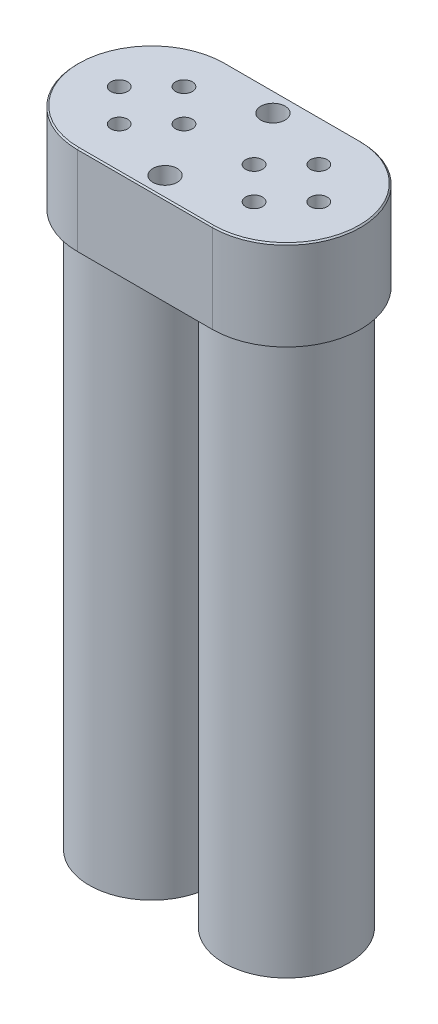
ISO-10303-21;
HEADER;
FILE_DESCRIPTION(('STEP AP214'),'2;1');
FILE_NAME('part.step','',(''),(''),'','','');
FILE_SCHEMA(('AUTOMOTIVE_DESIGN { 1 0 10303 214 1 1 1 1 }'));
ENDSEC;
DATA;
#1=APPLICATION_CONTEXT('core data for automotive mechanical design processes');
#2=APPLICATION_PROTOCOL_DEFINITION('international standard','automotive_design',2000,#1);
#3=PRODUCT_CONTEXT('',#1,'mechanical');
#4=PRODUCT('Part','Part','',(#3));
#5=PRODUCT_RELATED_PRODUCT_CATEGORY('part','',(#4));
#6=PRODUCT_DEFINITION_FORMATION('','',#4);
#7=PRODUCT_DEFINITION_CONTEXT('part definition',#1,'design');
#8=PRODUCT_DEFINITION('design','',#6,#7);
#9=PRODUCT_DEFINITION_SHAPE('','',#8);
#10=(LENGTH_UNIT() NAMED_UNIT(*) SI_UNIT(.MILLI.,.METRE.));
#11=(NAMED_UNIT(*) PLANE_ANGLE_UNIT() SI_UNIT($,.RADIAN.));
#12=(NAMED_UNIT(*) SI_UNIT($,.STERADIAN.) SOLID_ANGLE_UNIT());
#13=UNCERTAINTY_MEASURE_WITH_UNIT(LENGTH_MEASURE(1.E-05),#10,'distance_accuracy_value','');
#14=(GEOMETRIC_REPRESENTATION_CONTEXT(3) GLOBAL_UNCERTAINTY_ASSIGNED_CONTEXT((#13)) GLOBAL_UNIT_ASSIGNED_CONTEXT((#10,
#11,#12)) REPRESENTATION_CONTEXT('',''));
#15=CARTESIAN_POINT('',(0.,0.,0.));
#16=DIRECTION('',(0.,0.,1.));
#17=DIRECTION('',(1.,0.,0.));
#18=AXIS2_PLACEMENT_3D('',#15,#16,#17);
#19=CARTESIAN_POINT('',(0.,16.8656,0.));
#20=DIRECTION('',(0.,-1.,0.));
#21=DIRECTION('',(0.,0.,-1.));
#22=AXIS2_PLACEMENT_3D('',#19,#20,#21);
#23=CYLINDRICAL_SURFACE('',#22,13.97);
#24=DIRECTION('',(0.,-1.,0.));
#25=VECTOR('',#24,1.);
#26=CARTESIAN_POINT('',(0.,16.8656,13.97));
#27=LINE('',#26,#25);
#28=CARTESIAN_POINT('',(0.,16.6116,13.97));
#29=VERTEX_POINT('',#28);
#30=CARTESIAN_POINT('',(0.,0.,13.97));
#31=VERTEX_POINT('',#30);
#32=EDGE_CURVE('E91',#29,#31,#27,.T.);
#33=ORIENTED_EDGE('',*,*,#32,.F.);
#34=CARTESIAN_POINT('',(0.,16.6116,0.));
#35=DIRECTION('',(0.,1.,0.));
#36=DIRECTION('',(0.,0.,1.));
#37=AXIS2_PLACEMENT_3D('',#34,#35,#36);
#38=CIRCLE('',#37,13.97);
#39=CARTESIAN_POINT('',(0.,16.6116,-13.97));
#40=VERTEX_POINT('',#39);
#41=EDGE_CURVE('E61',#29,#40,#38,.F.);
#42=ORIENTED_EDGE('',*,*,#41,.T.);
#43=DIRECTION('',(0.,-1.,0.));
#44=VECTOR('',#43,1.);
#45=CARTESIAN_POINT('',(0.,16.8656,-13.97));
#46=LINE('',#45,#44);
#47=CARTESIAN_POINT('',(0.,0.,-13.97));
#48=VERTEX_POINT('',#47);
#49=EDGE_CURVE('E108',#40,#48,#46,.T.);
#50=ORIENTED_EDGE('',*,*,#49,.T.);
#51=CARTESIAN_POINT('',(0.,0.,0.));
#52=DIRECTION('',(0.,1.,0.));
#53=DIRECTION('',(0.,0.,1.));
#54=AXIS2_PLACEMENT_3D('',#51,#52,#53);
#55=CIRCLE('',#54,13.97);
#56=EDGE_CURVE('E104',#48,#31,#55,.T.);
#57=ORIENTED_EDGE('',*,*,#56,.T.);
#58=EDGE_LOOP('',(#33,#42,#50,#57));
#59=FACE_BOUND('',#58,.T.);
#60=ADVANCED_FACE('F36',(#59),#23,.T.);
#61=CARTESIAN_POINT('',(0.,16.8656,13.97));
#62=DIRECTION('',(0.,0.,-1.));
#63=DIRECTION('',(-1.,0.,0.));
#64=AXIS2_PLACEMENT_3D('',#61,#62,#63);
#65=PLANE('',#64);
#66=DIRECTION('',(0.,-1.,0.));
#67=VECTOR('',#66,1.);
#68=CARTESIAN_POINT('',(25.4,16.8656,13.97));
#69=LINE('',#68,#67);
#70=CARTESIAN_POINT('',(25.4,16.6116,13.97));
#71=VERTEX_POINT('',#70);
#72=CARTESIAN_POINT('',(25.4,0.,13.97));
#73=VERTEX_POINT('',#72);
#74=EDGE_CURVE('E98',#71,#73,#69,.T.);
#75=ORIENTED_EDGE('',*,*,#74,.F.);
#76=DIRECTION('',(-1.,0.,0.));
#77=VECTOR('',#76,1.);
#78=CARTESIAN_POINT('',(0.,16.6116,13.97));
#79=LINE('',#78,#77);
#80=EDGE_CURVE('E54',#71,#29,#79,.T.);
#81=ORIENTED_EDGE('',*,*,#80,.T.);
#82=ORIENTED_EDGE('',*,*,#32,.T.);
#83=DIRECTION('',(1.,0.,0.));
#84=VECTOR('',#83,1.);
#85=CARTESIAN_POINT('',(0.,0.,13.97));
#86=LINE('',#85,#84);
#87=EDGE_CURVE('E94',#31,#73,#86,.T.);
#88=ORIENTED_EDGE('',*,*,#87,.T.);
#89=EDGE_LOOP('',(#75,#81,#82,#88));
#90=FACE_BOUND('',#89,.T.);
#91=ADVANCED_FACE('F93',(#90),#65,.F.);
#92=CARTESIAN_POINT('',(25.4,16.8656,0.));
#93=DIRECTION('',(0.,-1.,0.));
#94=DIRECTION('',(0.,0.,-1.));
#95=AXIS2_PLACEMENT_3D('',#92,#93,#94);
#96=CYLINDRICAL_SURFACE('',#95,13.97);
#97=DIRECTION('',(0.,-1.,0.));
#98=VECTOR('',#97,1.);
#99=CARTESIAN_POINT('',(25.4,16.8656,-13.97));
#100=LINE('',#99,#98);
#101=CARTESIAN_POINT('',(25.4,16.6116,-13.97));
#102=VERTEX_POINT('',#101);
#103=CARTESIAN_POINT('',(25.4,0.,-13.97));
#104=VERTEX_POINT('',#103);
#105=EDGE_CURVE('E122',#102,#104,#100,.T.);
#106=ORIENTED_EDGE('',*,*,#105,.F.);
#107=CARTESIAN_POINT('',(25.4,16.6116,0.));
#108=DIRECTION('',(0.,1.,0.));
#109=DIRECTION('',(0.,0.,1.));
#110=AXIS2_PLACEMENT_3D('',#107,#108,#109);
#111=CIRCLE('',#110,13.97);
#112=EDGE_CURVE('E133',#102,#71,#111,.F.);
#113=ORIENTED_EDGE('',*,*,#112,.T.);
#114=ORIENTED_EDGE('',*,*,#74,.T.);
#115=CARTESIAN_POINT('',(25.4,0.,0.));
#116=DIRECTION('',(0.,1.,0.));
#117=DIRECTION('',(0.,0.,1.));
#118=AXIS2_PLACEMENT_3D('',#115,#116,#117);
#119=CIRCLE('',#118,13.97);
#120=EDGE_CURVE('E106',#73,#104,#119,.T.);
#121=ORIENTED_EDGE('',*,*,#120,.T.);
#122=EDGE_LOOP('',(#106,#113,#114,#121));
#123=FACE_BOUND('',#122,.T.);
#124=ADVANCED_FACE('F242',(#123),#96,.T.);
#125=CARTESIAN_POINT('',(0.,16.8656,-13.97));
#126=DIRECTION('',(0.,0.,1.));
#127=DIRECTION('',(1.,0.,0.));
#128=AXIS2_PLACEMENT_3D('',#125,#126,#127);
#129=PLANE('',#128);
#130=ORIENTED_EDGE('',*,*,#49,.F.);
#131=DIRECTION('',(1.,0.,0.));
#132=VECTOR('',#131,1.);
#133=CARTESIAN_POINT('',(25.4,16.6116,-13.97));
#134=LINE('',#133,#132);
#135=EDGE_CURVE('E136',#40,#102,#134,.T.);
#136=ORIENTED_EDGE('',*,*,#135,.T.);
#137=ORIENTED_EDGE('',*,*,#105,.T.);
#138=DIRECTION('',(-1.,0.,0.));
#139=VECTOR('',#138,1.);
#140=CARTESIAN_POINT('',(0.,0.,-13.97));
#141=LINE('',#140,#139);
#142=EDGE_CURVE('E119',#104,#48,#141,.T.);
#143=ORIENTED_EDGE('',*,*,#142,.T.);
#144=EDGE_LOOP('',(#130,#136,#137,#143));
#145=FACE_BOUND('',#144,.T.);
#146=ADVANCED_FACE('F233',(#145),#129,.F.);
#147=CARTESIAN_POINT('',(0.,16.8656,0.));
#148=DIRECTION('',(0.,1.,0.));
#149=DIRECTION('',(0.,0.,1.));
#150=AXIS2_PLACEMENT_3D('',#147,#148,#149);
#151=PLANE('',#150);
#152=CARTESIAN_POINT('',(12.7,16.8656,-10.16));
#153=DIRECTION('',(0.,1.,0.));
#154=DIRECTION('',(0.,0.,1.));
#155=AXIS2_PLACEMENT_3D('',#152,#153,#154);
#156=CIRCLE('',#155,2.286);
#157=CARTESIAN_POINT('',(12.7,16.8656,-7.874));
#158=VERTEX_POINT('',#157);
#159=EDGE_CURVE('E148',#158,#158,#156,.T.);
#160=ORIENTED_EDGE('',*,*,#159,.F.);
#161=EDGE_LOOP('',(#160));
#162=FACE_BOUND('',#161,.T.);
#163=CARTESIAN_POINT('',(12.7,16.8656,10.16));
#164=DIRECTION('',(0.,1.,0.));
#165=DIRECTION('',(0.,0.,-1.));
#166=AXIS2_PLACEMENT_3D('',#163,#164,#165);
#167=CIRCLE('',#166,2.286);
#168=CARTESIAN_POINT('',(12.7,16.8656,7.874));
#169=VERTEX_POINT('',#168);
#170=EDGE_CURVE('E154',#169,#169,#167,.T.);
#171=ORIENTED_EDGE('',*,*,#170,.F.);
#172=EDGE_LOOP('',(#171));
#173=FACE_BOUND('',#172,.T.);
#174=CARTESIAN_POINT('',(31.496,16.8656,0.));
#175=DIRECTION('',(0.,1.,0.));
#176=DIRECTION('',(0.,0.,1.));
#177=AXIS2_PLACEMENT_3D('',#174,#175,#176);
#178=CIRCLE('',#177,1.5875);
#179=CARTESIAN_POINT('',(31.496,16.8656,1.5875));
#180=VERTEX_POINT('',#179);
#181=EDGE_CURVE('E183',#180,#180,#178,.T.);
#182=ORIENTED_EDGE('',*,*,#181,.F.);
#183=EDGE_LOOP('',(#182));
#184=FACE_BOUND('',#183,.T.);
#185=CARTESIAN_POINT('',(25.4,16.8656,6.096));
#186=DIRECTION('',(0.,1.,0.));
#187=DIRECTION('',(0.,0.,1.));
#188=AXIS2_PLACEMENT_3D('',#185,#186,#187);
#189=CIRCLE('',#188,1.5875);
#190=CARTESIAN_POINT('',(25.4,16.8656,7.6835));
#191=VERTEX_POINT('',#190);
#192=EDGE_CURVE('E189',#191,#191,#189,.T.);
#193=ORIENTED_EDGE('',*,*,#192,.F.);
#194=EDGE_LOOP('',(#193));
#195=FACE_BOUND('',#194,.T.);
#196=CARTESIAN_POINT('',(19.304,16.8656,0.));
#197=DIRECTION('',(0.,1.,0.));
#198=DIRECTION('',(0.,0.,1.));
#199=AXIS2_PLACEMENT_3D('',#196,#197,#198);
#200=CIRCLE('',#199,1.5875);
#201=CARTESIAN_POINT('',(19.304,16.8656,1.5875));
#202=VERTEX_POINT('',#201);
#203=EDGE_CURVE('E195',#202,#202,#200,.T.);
#204=ORIENTED_EDGE('',*,*,#203,.F.);
#205=EDGE_LOOP('',(#204));
#206=FACE_BOUND('',#205,.T.);
#207=CARTESIAN_POINT('',(-6.096,16.8656,0.));
#208=DIRECTION('',(0.,1.,0.));
#209=DIRECTION('',(0.,0.,-1.));
#210=AXIS2_PLACEMENT_3D('',#207,#208,#209);
#211=CIRCLE('',#210,1.5875);
#212=CARTESIAN_POINT('',(-6.096,16.8656,-1.5875));
#213=VERTEX_POINT('',#212);
#214=EDGE_CURVE('E164',#213,#213,#211,.T.);
#215=ORIENTED_EDGE('',*,*,#214,.F.);
#216=EDGE_LOOP('',(#215));
#217=FACE_BOUND('',#216,.T.);
#218=CARTESIAN_POINT('',(6.096,16.8656,0.));
#219=DIRECTION('',(0.,1.,0.));
#220=DIRECTION('',(0.,0.,-1.));
#221=AXIS2_PLACEMENT_3D('',#218,#219,#220);
#222=CIRCLE('',#221,1.5875);
#223=CARTESIAN_POINT('',(6.096,16.8656,-1.5875));
#224=VERTEX_POINT('',#223);
#225=EDGE_CURVE('E165',#224,#224,#222,.T.);
#226=ORIENTED_EDGE('',*,*,#225,.F.);
#227=EDGE_LOOP('',(#226));
#228=FACE_BOUND('',#227,.T.);
#229=CARTESIAN_POINT('',(0.,16.8656,6.096));
#230=DIRECTION('',(0.,1.,0.));
#231=DIRECTION('',(0.,0.,-1.));
#232=AXIS2_PLACEMENT_3D('',#229,#230,#231);
#233=CIRCLE('',#232,1.5875);
#234=CARTESIAN_POINT('',(0.,16.8656,4.5085));
#235=VERTEX_POINT('',#234);
#236=EDGE_CURVE('E171',#235,#235,#233,.T.);
#237=ORIENTED_EDGE('',*,*,#236,.F.);
#238=EDGE_LOOP('',(#237));
#239=FACE_BOUND('',#238,.T.);
#240=CARTESIAN_POINT('',(0.,16.8656,-6.096));
#241=DIRECTION('',(0.,1.,0.));
#242=DIRECTION('',(0.,0.,-1.));
#243=AXIS2_PLACEMENT_3D('',#240,#241,#242);
#244=CIRCLE('',#243,1.5875);
#245=CARTESIAN_POINT('',(0.,16.8656,-7.6835));
#246=VERTEX_POINT('',#245);
#247=EDGE_CURVE('E152',#246,#246,#244,.T.);
#248=ORIENTED_EDGE('',*,*,#247,.F.);
#249=EDGE_LOOP('',(#248));
#250=FACE_BOUND('',#249,.T.);
#251=CARTESIAN_POINT('',(25.4,16.8656,-6.096));
#252=DIRECTION('',(0.,1.,0.));
#253=DIRECTION('',(0.,0.,1.));
#254=AXIS2_PLACEMENT_3D('',#251,#252,#253);
#255=CIRCLE('',#254,1.5875);
#256=CARTESIAN_POINT('',(25.4,16.8656,-4.5085));
#257=VERTEX_POINT('',#256);
#258=EDGE_CURVE('E182',#257,#257,#255,.T.);
#259=ORIENTED_EDGE('',*,*,#258,.F.);
#260=EDGE_LOOP('',(#259));
#261=FACE_BOUND('',#260,.T.);
#262=DIRECTION('',(1.,0.,0.));
#263=VECTOR('',#262,1.);
#264=CARTESIAN_POINT('',(25.4,16.8656,13.716));
#265=LINE('',#264,#263);
#266=CARTESIAN_POINT('',(0.,16.8656,13.716));
#267=VERTEX_POINT('',#266);
#268=CARTESIAN_POINT('',(25.4,16.8656,13.716));
#269=VERTEX_POINT('',#268);
#270=EDGE_CURVE('E126',#267,#269,#265,.T.);
#271=ORIENTED_EDGE('',*,*,#270,.T.);
#272=CARTESIAN_POINT('',(25.4,16.8656,0.));
#273=DIRECTION('',(0.,1.,0.));
#274=DIRECTION('',(0.,0.,1.));
#275=AXIS2_PLACEMENT_3D('',#272,#273,#274);
#276=CIRCLE('',#275,13.716);
#277=CARTESIAN_POINT('',(25.4,16.8656,-13.716));
#278=VERTEX_POINT('',#277);
#279=EDGE_CURVE('E130',#269,#278,#276,.T.);
#280=ORIENTED_EDGE('',*,*,#279,.T.);
#281=DIRECTION('',(-1.,0.,0.));
#282=VECTOR('',#281,1.);
#283=CARTESIAN_POINT('',(0.,16.8656,-13.716));
#284=LINE('',#283,#282);
#285=CARTESIAN_POINT('',(0.,16.8656,-13.716));
#286=VERTEX_POINT('',#285);
#287=EDGE_CURVE('E128',#278,#286,#284,.T.);
#288=ORIENTED_EDGE('',*,*,#287,.T.);
#289=CARTESIAN_POINT('',(0.,16.8656,0.));
#290=DIRECTION('',(0.,1.,0.));
#291=DIRECTION('',(0.,0.,1.));
#292=AXIS2_PLACEMENT_3D('',#289,#290,#291);
#293=CIRCLE('',#292,13.716);
#294=EDGE_CURVE('E97',#286,#267,#293,.T.);
#295=ORIENTED_EDGE('',*,*,#294,.T.);
#296=EDGE_LOOP('',(#271,#280,#288,#295));
#297=FACE_BOUND('',#296,.T.);
#298=ADVANCED_FACE('F224',(#162,#173,#184,#195,#206,#217,#228,#239,#250,#261,#297),#151,.T.);
#299=CARTESIAN_POINT('',(0.,0.,0.));
#300=DIRECTION('',(0.,1.,0.));
#301=DIRECTION('',(0.,0.,1.));
#302=AXIS2_PLACEMENT_3D('',#299,#300,#301);
#303=PLANE('',#302);
#304=CARTESIAN_POINT('',(12.7,0.,-10.16));
#305=DIRECTION('',(0.,1.,0.));
#306=DIRECTION('',(0.,0.,1.));
#307=AXIS2_PLACEMENT_3D('',#304,#305,#306);
#308=CIRCLE('',#307,2.286);
#309=CARTESIAN_POINT('',(12.7,0.,-7.874));
#310=VERTEX_POINT('',#309);
#311=EDGE_CURVE('E41',#310,#310,#308,.T.);
#312=ORIENTED_EDGE('',*,*,#311,.T.);
#313=EDGE_LOOP('',(#312));
#314=FACE_BOUND('',#313,.T.);
#315=CARTESIAN_POINT('',(12.7,0.,10.16));
#316=DIRECTION('',(0.,1.,0.));
#317=DIRECTION('',(0.,0.,1.));
#318=AXIS2_PLACEMENT_3D('',#315,#316,#317);
#319=CIRCLE('',#318,2.286);
#320=CARTESIAN_POINT('',(12.7,0.,12.446));
#321=VERTEX_POINT('',#320);
#322=EDGE_CURVE('E146',#321,#321,#319,.T.);
#323=ORIENTED_EDGE('',*,*,#322,.T.);
#324=EDGE_LOOP('',(#323));
#325=FACE_BOUND('',#324,.T.);
#326=CARTESIAN_POINT('',(25.4,0.,0.));
#327=DIRECTION('',(0.,1.,0.));
#328=DIRECTION('',(0.,0.,1.));
#329=AXIS2_PLACEMENT_3D('',#326,#327,#328);
#330=CIRCLE('',#329,11.7475);
#331=CARTESIAN_POINT('',(25.4,0.,11.7475));
#332=VERTEX_POINT('',#331);
#333=EDGE_CURVE('E11',#332,#332,#330,.F.);
#334=ORIENTED_EDGE('',*,*,#333,.F.);
#335=EDGE_LOOP('',(#334));
#336=FACE_BOUND('',#335,.T.);
#337=CARTESIAN_POINT('',(0.,0.,0.));
#338=DIRECTION('',(0.,-1.,0.));
#339=DIRECTION('',(0.,0.,-1.));
#340=AXIS2_PLACEMENT_3D('',#337,#338,#339);
#341=CIRCLE('',#340,11.7475);
#342=CARTESIAN_POINT('',(0.,0.,-11.7475));
#343=VERTEX_POINT('',#342);
#344=EDGE_CURVE('E46',#343,#343,#341,.T.);
#345=ORIENTED_EDGE('',*,*,#344,.F.);
#346=EDGE_LOOP('',(#345));
#347=FACE_BOUND('',#346,.T.);
#348=ORIENTED_EDGE('',*,*,#56,.F.);
#349=ORIENTED_EDGE('',*,*,#142,.F.);
#350=ORIENTED_EDGE('',*,*,#120,.F.);
#351=ORIENTED_EDGE('',*,*,#87,.F.);
#352=EDGE_LOOP('',(#348,#349,#350,#351));
#353=FACE_BOUND('',#352,.T.);
#354=ADVANCED_FACE('F102',(#314,#325,#336,#347,#353),#303,.F.);
#355=CARTESIAN_POINT('',(0.,16.8656,0.));
#356=DIRECTION('',(0.,-1.,0.));
#357=DIRECTION('',(0.,0.,-1.));
#358=AXIS2_PLACEMENT_3D('',#355,#356,#357);
#359=CONICAL_SURFACE('',#358,13.716,0.785398163397442);
#360=DIRECTION('',(0.,0.707106781186552,0.707106781186543));
#361=VECTOR('',#360,1.);
#362=CARTESIAN_POINT('',(0.,16.6116,-13.97));
#363=LINE('',#362,#361);
#364=EDGE_CURVE('E113',#40,#286,#363,.T.);
#365=ORIENTED_EDGE('',*,*,#364,.F.);
#366=ORIENTED_EDGE('',*,*,#41,.F.);
#367=DIRECTION('',(0.,-0.707106781186552,0.707106781186543));
#368=VECTOR('',#367,1.);
#369=CARTESIAN_POINT('',(0.,16.8656,13.716));
#370=LINE('',#369,#368);
#371=EDGE_CURVE('E110',#267,#29,#370,.T.);
#372=ORIENTED_EDGE('',*,*,#371,.F.);
#373=ORIENTED_EDGE('',*,*,#294,.F.);
#374=EDGE_LOOP('',(#365,#366,#372,#373));
#375=FACE_BOUND('',#374,.T.);
#376=ADVANCED_FACE('F39',(#375),#359,.T.);
#377=CARTESIAN_POINT('',(0.,16.8656,13.716));
#378=DIRECTION('',(0.,0.707106781186543,0.707106781186552));
#379=DIRECTION('',(-1.,0.,0.));
#380=AXIS2_PLACEMENT_3D('',#377,#378,#379);
#381=PLANE('',#380);
#382=ORIENTED_EDGE('',*,*,#371,.T.);
#383=ORIENTED_EDGE('',*,*,#80,.F.);
#384=DIRECTION('',(0.,-0.707106781186552,0.707106781186543));
#385=VECTOR('',#384,1.);
#386=CARTESIAN_POINT('',(25.4,16.8656,13.716));
#387=LINE('',#386,#385);
#388=EDGE_CURVE('E142',#269,#71,#387,.T.);
#389=ORIENTED_EDGE('',*,*,#388,.F.);
#390=ORIENTED_EDGE('',*,*,#270,.F.);
#391=EDGE_LOOP('',(#382,#383,#389,#390));
#392=FACE_BOUND('',#391,.T.);
#393=ADVANCED_FACE('F231',(#392),#381,.T.);
#394=CARTESIAN_POINT('',(0.,16.8656,-13.716));
#395=DIRECTION('',(0.,0.707106781186543,-0.707106781186552));
#396=DIRECTION('',(1.,0.,0.));
#397=AXIS2_PLACEMENT_3D('',#394,#395,#396);
#398=PLANE('',#397);
#399=ORIENTED_EDGE('',*,*,#364,.T.);
#400=ORIENTED_EDGE('',*,*,#287,.F.);
#401=DIRECTION('',(0.,0.707106781186552,0.707106781186543));
#402=VECTOR('',#401,1.);
#403=CARTESIAN_POINT('',(25.4,16.6116,-13.97));
#404=LINE('',#403,#402);
#405=EDGE_CURVE('E140',#102,#278,#404,.T.);
#406=ORIENTED_EDGE('',*,*,#405,.F.);
#407=ORIENTED_EDGE('',*,*,#135,.F.);
#408=EDGE_LOOP('',(#399,#400,#406,#407));
#409=FACE_BOUND('',#408,.T.);
#410=ADVANCED_FACE('F252',(#409),#398,.T.);
#411=CARTESIAN_POINT('',(25.4,16.8656,0.));
#412=DIRECTION('',(0.,-1.,0.));
#413=DIRECTION('',(0.,0.,-1.));
#414=AXIS2_PLACEMENT_3D('',#411,#412,#413);
#415=CONICAL_SURFACE('',#414,13.716,0.785398163397442);
#416=ORIENTED_EDGE('',*,*,#388,.T.);
#417=ORIENTED_EDGE('',*,*,#112,.F.);
#418=ORIENTED_EDGE('',*,*,#405,.T.);
#419=ORIENTED_EDGE('',*,*,#279,.F.);
#420=EDGE_LOOP('',(#416,#417,#418,#419));
#421=FACE_BOUND('',#420,.T.);
#422=ADVANCED_FACE('F218',(#421),#415,.T.);
#423=CARTESIAN_POINT('',(0.,-104.521,0.));
#424=DIRECTION('',(0.,1.,0.));
#425=DIRECTION('',(0.,0.,1.));
#426=AXIS2_PLACEMENT_3D('',#423,#424,#425);
#427=CYLINDRICAL_SURFACE('',#426,11.7475);
#428=CARTESIAN_POINT('',(0.,-104.521,0.));
#429=DIRECTION('',(0.,-1.,0.));
#430=DIRECTION('',(0.,0.,-1.));
#431=AXIS2_PLACEMENT_3D('',#428,#429,#430);
#432=CIRCLE('',#431,11.7475);
#433=CARTESIAN_POINT('',(0.,-104.521,-11.7475));
#434=VERTEX_POINT('',#433);
#435=EDGE_CURVE('E143',#434,#434,#432,.T.);
#436=ORIENTED_EDGE('',*,*,#435,.F.);
#437=EDGE_LOOP('',(#436));
#438=FACE_BOUND('',#437,.T.);
#439=ORIENTED_EDGE('',*,*,#344,.T.);
#440=EDGE_LOOP('',(#439));
#441=FACE_BOUND('',#440,.T.);
#442=ADVANCED_FACE('F215',(#438,#441),#427,.T.);
#443=CARTESIAN_POINT('',(0.,-104.521,0.));
#444=DIRECTION('',(0.,-1.,0.));
#445=DIRECTION('',(0.,0.,-1.));
#446=AXIS2_PLACEMENT_3D('',#443,#444,#445);
#447=PLANE('',#446);
#448=ORIENTED_EDGE('',*,*,#435,.T.);
#449=EDGE_LOOP('',(#448));
#450=FACE_BOUND('',#449,.T.);
#451=ADVANCED_FACE('F213',(#450),#447,.T.);
#452=CARTESIAN_POINT('',(25.4,-104.521,0.));
#453=DIRECTION('',(0.,1.,0.));
#454=DIRECTION('',(0.,0.,1.));
#455=AXIS2_PLACEMENT_3D('',#452,#453,#454);
#456=CYLINDRICAL_SURFACE('',#455,11.7475);
#457=CARTESIAN_POINT('',(25.4,-104.521,0.));
#458=DIRECTION('',(0.,-1.,0.));
#459=DIRECTION('',(0.,0.,-1.));
#460=AXIS2_PLACEMENT_3D('',#457,#458,#459);
#461=CIRCLE('',#460,11.7475);
#462=CARTESIAN_POINT('',(25.4,-104.521,-11.7475));
#463=VERTEX_POINT('',#462);
#464=EDGE_CURVE('E206',#463,#463,#461,.T.);
#465=ORIENTED_EDGE('',*,*,#464,.F.);
#466=EDGE_LOOP('',(#465));
#467=FACE_BOUND('',#466,.T.);
#468=ORIENTED_EDGE('',*,*,#333,.T.);
#469=EDGE_LOOP('',(#468));
#470=FACE_BOUND('',#469,.T.);
#471=ADVANCED_FACE('F391',(#467,#470),#456,.T.);
#472=CARTESIAN_POINT('',(25.4,-104.521,0.));
#473=DIRECTION('',(0.,-1.,0.));
#474=DIRECTION('',(0.,0.,-1.));
#475=AXIS2_PLACEMENT_3D('',#472,#473,#474);
#476=PLANE('',#475);
#477=ORIENTED_EDGE('',*,*,#464,.T.);
#478=EDGE_LOOP('',(#477));
#479=FACE_BOUND('',#478,.T.);
#480=ADVANCED_FACE('F387',(#479),#476,.T.);
#481=CARTESIAN_POINT('',(25.4,0.508000000000002,-6.096));
#482=DIRECTION('',(0.,1.,0.));
#483=DIRECTION('',(0.,0.,1.));
#484=AXIS2_PLACEMENT_3D('',#481,#482,#483);
#485=CYLINDRICAL_SURFACE('',#484,1.5875);
#486=CARTESIAN_POINT('',(25.4,0.508000000000002,-6.096));
#487=DIRECTION('',(0.,1.,0.));
#488=DIRECTION('',(0.,0.,1.));
#489=AXIS2_PLACEMENT_3D('',#486,#487,#488);
#490=CIRCLE('',#489,1.5875);
#491=CARTESIAN_POINT('',(25.4,0.508000000000002,-4.5085));
#492=VERTEX_POINT('',#491);
#493=EDGE_CURVE('E203',#492,#492,#490,.T.);
#494=ORIENTED_EDGE('',*,*,#493,.F.);
#495=EDGE_LOOP('',(#494));
#496=FACE_BOUND('',#495,.T.);
#497=ORIENTED_EDGE('',*,*,#258,.T.);
#498=EDGE_LOOP('',(#497));
#499=FACE_BOUND('',#498,.T.);
#500=ADVANCED_FACE('F383',(#496,#499),#485,.F.);
#501=CARTESIAN_POINT('',(25.4,0.508000000000002,-6.096));
#502=DIRECTION('',(0.,1.,0.));
#503=DIRECTION('',(0.,0.,1.));
#504=AXIS2_PLACEMENT_3D('',#501,#502,#503);
#505=PLANE('',#504);
#506=ORIENTED_EDGE('',*,*,#493,.T.);
#507=EDGE_LOOP('',(#506));
#508=FACE_BOUND('',#507,.T.);
#509=ADVANCED_FACE('F350',(#508),#505,.T.);
#510=CARTESIAN_POINT('',(0.,0.508000000000002,-6.096));
#511=DIRECTION('',(0.,1.,0.));
#512=DIRECTION('',(0.,0.,1.));
#513=AXIS2_PLACEMENT_3D('',#510,#511,#512);
#514=CYLINDRICAL_SURFACE('',#513,1.5875);
#515=CARTESIAN_POINT('',(0.,0.508000000000002,-6.096));
#516=DIRECTION('',(0.,1.,0.));
#517=DIRECTION('',(0.,0.,-1.));
#518=AXIS2_PLACEMENT_3D('',#515,#516,#517);
#519=CIRCLE('',#518,1.5875);
#520=CARTESIAN_POINT('',(0.,0.508000000000002,-7.6835));
#521=VERTEX_POINT('',#520);
#522=EDGE_CURVE('E174',#521,#521,#519,.T.);
#523=ORIENTED_EDGE('',*,*,#522,.F.);
#524=EDGE_LOOP('',(#523));
#525=FACE_BOUND('',#524,.T.);
#526=ORIENTED_EDGE('',*,*,#247,.T.);
#527=EDGE_LOOP('',(#526));
#528=FACE_BOUND('',#527,.T.);
#529=ADVANCED_FACE('F346',(#525,#528),#514,.F.);
#530=CARTESIAN_POINT('',(0.,0.508000000000002,-6.096));
#531=DIRECTION('',(0.,-1.,0.));
#532=DIRECTION('',(0.,0.,-1.));
#533=AXIS2_PLACEMENT_3D('',#530,#531,#532);
#534=PLANE('',#533);
#535=ORIENTED_EDGE('',*,*,#522,.T.);
#536=EDGE_LOOP('',(#535));
#537=FACE_BOUND('',#536,.T.);
#538=ADVANCED_FACE('F342',(#537),#534,.F.);
#539=CARTESIAN_POINT('',(0.,0.508000000000002,6.096));
#540=DIRECTION('',(0.,1.,0.));
#541=DIRECTION('',(0.,0.,1.));
#542=AXIS2_PLACEMENT_3D('',#539,#540,#541);
#543=CYLINDRICAL_SURFACE('',#542,1.5875);
#544=CARTESIAN_POINT('',(0.,0.508000000000002,6.096));
#545=DIRECTION('',(0.,1.,0.));
#546=DIRECTION('',(0.,0.,-1.));
#547=AXIS2_PLACEMENT_3D('',#544,#545,#546);
#548=CIRCLE('',#547,1.5875);
#549=CARTESIAN_POINT('',(0.,0.508000000000002,4.5085));
#550=VERTEX_POINT('',#549);
#551=EDGE_CURVE('E168',#550,#550,#548,.T.);
#552=ORIENTED_EDGE('',*,*,#551,.F.);
#553=EDGE_LOOP('',(#552));
#554=FACE_BOUND('',#553,.T.);
#555=ORIENTED_EDGE('',*,*,#236,.T.);
#556=EDGE_LOOP('',(#555));
#557=FACE_BOUND('',#556,.T.);
#558=ADVANCED_FACE('F338',(#554,#557),#543,.F.);
#559=CARTESIAN_POINT('',(0.,0.508000000000002,6.096));
#560=DIRECTION('',(0.,-1.,0.));
#561=DIRECTION('',(0.,0.,-1.));
#562=AXIS2_PLACEMENT_3D('',#559,#560,#561);
#563=PLANE('',#562);
#564=ORIENTED_EDGE('',*,*,#551,.T.);
#565=EDGE_LOOP('',(#564));
#566=FACE_BOUND('',#565,.T.);
#567=ADVANCED_FACE('F334',(#566),#563,.F.);
#568=CARTESIAN_POINT('',(6.096,0.508000000000002,0.));
#569=DIRECTION('',(0.,1.,0.));
#570=DIRECTION('',(0.,0.,1.));
#571=AXIS2_PLACEMENT_3D('',#568,#569,#570);
#572=CYLINDRICAL_SURFACE('',#571,1.5875);
#573=CARTESIAN_POINT('',(6.096,0.508000000000002,0.));
#574=DIRECTION('',(0.,1.,0.));
#575=DIRECTION('',(0.,0.,-1.));
#576=AXIS2_PLACEMENT_3D('',#573,#574,#575);
#577=CIRCLE('',#576,1.5875);
#578=CARTESIAN_POINT('',(6.096,0.508000000000002,-1.5875));
#579=VERTEX_POINT('',#578);
#580=EDGE_CURVE('E161',#579,#579,#577,.T.);
#581=ORIENTED_EDGE('',*,*,#580,.F.);
#582=EDGE_LOOP('',(#581));
#583=FACE_BOUND('',#582,.T.);
#584=ORIENTED_EDGE('',*,*,#225,.T.);
#585=EDGE_LOOP('',(#584));
#586=FACE_BOUND('',#585,.T.);
#587=ADVANCED_FACE('F330',(#583,#586),#572,.F.);
#588=CARTESIAN_POINT('',(6.096,0.508000000000002,0.));
#589=DIRECTION('',(0.,-1.,0.));
#590=DIRECTION('',(0.,0.,-1.));
#591=AXIS2_PLACEMENT_3D('',#588,#589,#590);
#592=PLANE('',#591);
#593=ORIENTED_EDGE('',*,*,#580,.T.);
#594=EDGE_LOOP('',(#593));
#595=FACE_BOUND('',#594,.T.);
#596=ADVANCED_FACE('F326',(#595),#592,.F.);
#597=CARTESIAN_POINT('',(-6.096,0.508000000000002,0.));
#598=DIRECTION('',(0.,1.,0.));
#599=DIRECTION('',(0.,0.,1.));
#600=AXIS2_PLACEMENT_3D('',#597,#598,#599);
#601=CYLINDRICAL_SURFACE('',#600,1.5875);
#602=CARTESIAN_POINT('',(-6.096,0.508000000000002,0.));
#603=DIRECTION('',(0.,1.,0.));
#604=DIRECTION('',(0.,0.,-1.));
#605=AXIS2_PLACEMENT_3D('',#602,#603,#604);
#606=CIRCLE('',#605,1.5875);
#607=CARTESIAN_POINT('',(-6.096,0.508000000000002,-1.5875));
#608=VERTEX_POINT('',#607);
#609=EDGE_CURVE('E198',#608,#608,#606,.T.);
#610=ORIENTED_EDGE('',*,*,#609,.F.);
#611=EDGE_LOOP('',(#610));
#612=FACE_BOUND('',#611,.T.);
#613=ORIENTED_EDGE('',*,*,#214,.T.);
#614=EDGE_LOOP('',(#613));
#615=FACE_BOUND('',#614,.T.);
#616=ADVANCED_FACE('F329',(#612,#615),#601,.F.);
#617=CARTESIAN_POINT('',(-6.096,0.508000000000002,0.));
#618=DIRECTION('',(0.,-1.,0.));
#619=DIRECTION('',(0.,0.,-1.));
#620=AXIS2_PLACEMENT_3D('',#617,#618,#619);
#621=PLANE('',#620);
#622=ORIENTED_EDGE('',*,*,#609,.T.);
#623=EDGE_LOOP('',(#622));
#624=FACE_BOUND('',#623,.T.);
#625=ADVANCED_FACE('F373',(#624),#621,.F.);
#626=CARTESIAN_POINT('',(19.304,0.508000000000002,0.));
#627=DIRECTION('',(0.,1.,0.));
#628=DIRECTION('',(0.,0.,1.));
#629=AXIS2_PLACEMENT_3D('',#626,#627,#628);
#630=CYLINDRICAL_SURFACE('',#629,1.5875);
#631=CARTESIAN_POINT('',(19.304,0.508000000000002,0.));
#632=DIRECTION('',(0.,1.,0.));
#633=DIRECTION('',(0.,0.,1.));
#634=AXIS2_PLACEMENT_3D('',#631,#632,#633);
#635=CIRCLE('',#634,1.5875);
#636=CARTESIAN_POINT('',(19.304,0.508000000000002,1.5875));
#637=VERTEX_POINT('',#636);
#638=EDGE_CURVE('E192',#637,#637,#635,.T.);
#639=ORIENTED_EDGE('',*,*,#638,.F.);
#640=EDGE_LOOP('',(#639));
#641=FACE_BOUND('',#640,.T.);
#642=ORIENTED_EDGE('',*,*,#203,.T.);
#643=EDGE_LOOP('',(#642));
#644=FACE_BOUND('',#643,.T.);
#645=ADVANCED_FACE('F369',(#641,#644),#630,.F.);
#646=CARTESIAN_POINT('',(19.304,0.508000000000002,0.));
#647=DIRECTION('',(0.,1.,0.));
#648=DIRECTION('',(0.,0.,1.));
#649=AXIS2_PLACEMENT_3D('',#646,#647,#648);
#650=PLANE('',#649);
#651=ORIENTED_EDGE('',*,*,#638,.T.);
#652=EDGE_LOOP('',(#651));
#653=FACE_BOUND('',#652,.T.);
#654=ADVANCED_FACE('F365',(#653),#650,.T.);
#655=CARTESIAN_POINT('',(25.4,0.508000000000002,6.096));
#656=DIRECTION('',(0.,1.,0.));
#657=DIRECTION('',(0.,0.,1.));
#658=AXIS2_PLACEMENT_3D('',#655,#656,#657);
#659=CYLINDRICAL_SURFACE('',#658,1.5875);
#660=CARTESIAN_POINT('',(25.4,0.508000000000002,6.096));
#661=DIRECTION('',(0.,1.,0.));
#662=DIRECTION('',(0.,0.,1.));
#663=AXIS2_PLACEMENT_3D('',#660,#661,#662);
#664=CIRCLE('',#663,1.5875);
#665=CARTESIAN_POINT('',(25.4,0.508000000000002,7.6835));
#666=VERTEX_POINT('',#665);
#667=EDGE_CURVE('E186',#666,#666,#664,.T.);
#668=ORIENTED_EDGE('',*,*,#667,.F.);
#669=EDGE_LOOP('',(#668));
#670=FACE_BOUND('',#669,.T.);
#671=ORIENTED_EDGE('',*,*,#192,.T.);
#672=EDGE_LOOP('',(#671));
#673=FACE_BOUND('',#672,.T.);
#674=ADVANCED_FACE('F361',(#670,#673),#659,.F.);
#675=CARTESIAN_POINT('',(25.4,0.508000000000002,6.096));
#676=DIRECTION('',(0.,1.,0.));
#677=DIRECTION('',(0.,0.,1.));
#678=AXIS2_PLACEMENT_3D('',#675,#676,#677);
#679=PLANE('',#678);
#680=ORIENTED_EDGE('',*,*,#667,.T.);
#681=EDGE_LOOP('',(#680));
#682=FACE_BOUND('',#681,.T.);
#683=ADVANCED_FACE('F357',(#682),#679,.T.);
#684=CARTESIAN_POINT('',(31.496,0.508000000000002,0.));
#685=DIRECTION('',(0.,1.,0.));
#686=DIRECTION('',(0.,0.,1.));
#687=AXIS2_PLACEMENT_3D('',#684,#685,#686);
#688=CYLINDRICAL_SURFACE('',#687,1.5875);
#689=CARTESIAN_POINT('',(31.496,0.508000000000002,0.));
#690=DIRECTION('',(0.,1.,0.));
#691=DIRECTION('',(0.,0.,1.));
#692=AXIS2_PLACEMENT_3D('',#689,#690,#691);
#693=CIRCLE('',#692,1.5875);
#694=CARTESIAN_POINT('',(31.496,0.508000000000002,1.5875));
#695=VERTEX_POINT('',#694);
#696=EDGE_CURVE('E179',#695,#695,#693,.T.);
#697=ORIENTED_EDGE('',*,*,#696,.F.);
#698=EDGE_LOOP('',(#697));
#699=FACE_BOUND('',#698,.T.);
#700=ORIENTED_EDGE('',*,*,#181,.T.);
#701=EDGE_LOOP('',(#700));
#702=FACE_BOUND('',#701,.T.);
#703=ADVANCED_FACE('F353',(#699,#702),#688,.F.);
#704=CARTESIAN_POINT('',(31.496,0.508000000000002,0.));
#705=DIRECTION('',(0.,1.,0.));
#706=DIRECTION('',(0.,0.,1.));
#707=AXIS2_PLACEMENT_3D('',#704,#705,#706);
#708=PLANE('',#707);
#709=ORIENTED_EDGE('',*,*,#696,.T.);
#710=EDGE_LOOP('',(#709));
#711=FACE_BOUND('',#710,.T.);
#712=ADVANCED_FACE('F296',(#711),#708,.T.);
#713=CARTESIAN_POINT('',(12.7,-104.521,10.16));
#714=DIRECTION('',(0.,1.,0.));
#715=DIRECTION('',(0.,0.,1.));
#716=AXIS2_PLACEMENT_3D('',#713,#714,#715);
#717=CYLINDRICAL_SURFACE('',#716,2.286);
#718=ORIENTED_EDGE('',*,*,#170,.T.);
#719=EDGE_LOOP('',(#718));
#720=FACE_BOUND('',#719,.T.);
#721=ORIENTED_EDGE('',*,*,#322,.F.);
#722=EDGE_LOOP('',(#721));
#723=FACE_BOUND('',#722,.T.);
#724=ADVANCED_FACE('F306',(#720,#723),#717,.F.);
#725=CARTESIAN_POINT('',(12.7,-104.521,-10.16));
#726=DIRECTION('',(0.,1.,0.));
#727=DIRECTION('',(0.,0.,1.));
#728=AXIS2_PLACEMENT_3D('',#725,#726,#727);
#729=CYLINDRICAL_SURFACE('',#728,2.286);
#730=ORIENTED_EDGE('',*,*,#159,.T.);
#731=EDGE_LOOP('',(#730));
#732=FACE_BOUND('',#731,.T.);
#733=ORIENTED_EDGE('',*,*,#311,.F.);
#734=EDGE_LOOP('',(#733));
#735=FACE_BOUND('',#734,.T.);
#736=ADVANCED_FACE('F311',(#732,#735),#729,.F.);
#737=CLOSED_SHELL('',(#60,#91,#124,#146,#298,#354,#376,#393,#410,#422,#442,#451,#471,#480,#500,
#509,#529,#538,#558,#567,#587,#596,#616,#625,#645,#654,#674,#683,#703,#712,#724,#736));
#738=MANIFOLD_SOLID_BREP('B2',#737);
#739=ADVANCED_BREP_SHAPE_REPRESENTATION('',(#18,#738),#14);
#740=SHAPE_DEFINITION_REPRESENTATION(#9,#739);
ENDSEC;
END-ISO-10303-21;
